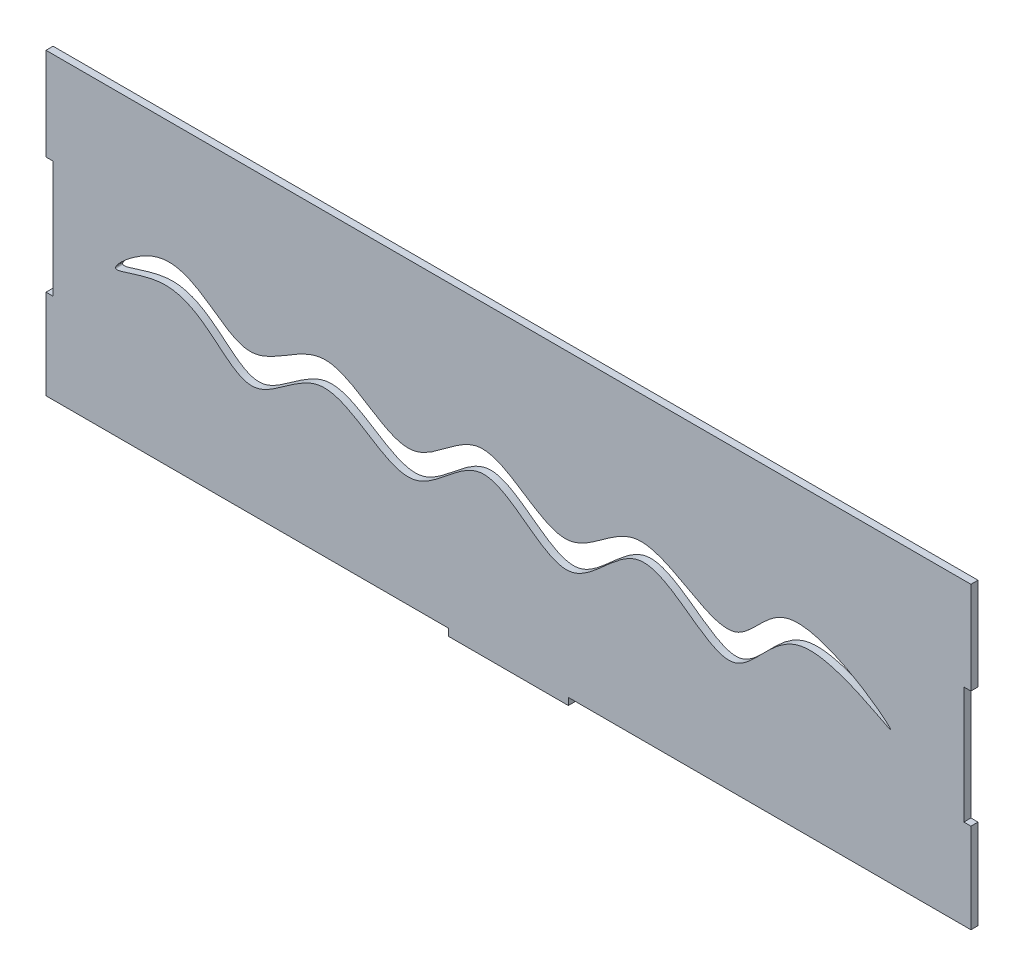
ISO-10303-21;
HEADER;
FILE_DESCRIPTION(('STEP AP214'),'2;1');
FILE_NAME('part.step','',(''),(''),'','','');
FILE_SCHEMA(('AUTOMOTIVE_DESIGN { 1 0 10303 214 1 1 1 1 }'));
ENDSEC;
DATA;
#1=APPLICATION_CONTEXT('core data for automotive mechanical design processes');
#2=APPLICATION_PROTOCOL_DEFINITION('international standard','automotive_design',2000,#1);
#3=PRODUCT_CONTEXT('',#1,'mechanical');
#4=PRODUCT('Part','Part','',(#3));
#5=PRODUCT_RELATED_PRODUCT_CATEGORY('part','',(#4));
#6=PRODUCT_DEFINITION_FORMATION('','',#4);
#7=PRODUCT_DEFINITION_CONTEXT('part definition',#1,'design');
#8=PRODUCT_DEFINITION('design','',#6,#7);
#9=PRODUCT_DEFINITION_SHAPE('','',#8);
#10=(LENGTH_UNIT() NAMED_UNIT(*) SI_UNIT(.MILLI.,.METRE.));
#11=(NAMED_UNIT(*) PLANE_ANGLE_UNIT() SI_UNIT($,.RADIAN.));
#12=(NAMED_UNIT(*) SI_UNIT($,.STERADIAN.) SOLID_ANGLE_UNIT());
#13=UNCERTAINTY_MEASURE_WITH_UNIT(LENGTH_MEASURE(1.E-05),#10,'distance_accuracy_value','');
#14=(GEOMETRIC_REPRESENTATION_CONTEXT(3) GLOBAL_UNCERTAINTY_ASSIGNED_CONTEXT((#13)) GLOBAL_UNIT_ASSIGNED_CONTEXT((#10,
#11,#12)) REPRESENTATION_CONTEXT('',''));
#15=CARTESIAN_POINT('',(0.,0.,0.));
#16=DIRECTION('',(0.,0.,1.));
#17=DIRECTION('',(1.,0.,0.));
#18=AXIS2_PLACEMENT_3D('',#15,#16,#17);
#19=CARTESIAN_POINT('',(0.,33.,2.6));
#20=DIRECTION('',(1.,0.,0.));
#21=DIRECTION('',(0.,1.,0.));
#22=AXIS2_PLACEMENT_3D('',#19,#20,#21);
#23=PLANE('',#22);
#24=DIRECTION('',(0.,-1.,0.));
#25=VECTOR('',#24,1.);
#26=CARTESIAN_POINT('',(0.,33.,0.));
#27=LINE('',#26,#25);
#28=CARTESIAN_POINT('',(0.,33.,0.));
#29=VERTEX_POINT('',#28);
#30=CARTESIAN_POINT('',(0.,0.,0.));
#31=VERTEX_POINT('',#30);
#32=EDGE_CURVE('E190',#29,#31,#27,.T.);
#33=ORIENTED_EDGE('',*,*,#32,.T.);
#34=DIRECTION('',(0.,0.,-1.));
#35=VECTOR('',#34,1.);
#36=CARTESIAN_POINT('',(0.,0.,2.6));
#37=LINE('',#36,#35);
#38=CARTESIAN_POINT('',(0.,0.,2.6));
#39=VERTEX_POINT('',#38);
#40=EDGE_CURVE('E11',#39,#31,#37,.T.);
#41=ORIENTED_EDGE('',*,*,#40,.F.);
#42=DIRECTION('',(0.,-1.,0.));
#43=VECTOR('',#42,1.);
#44=CARTESIAN_POINT('',(0.,33.,2.6));
#45=LINE('',#44,#43);
#46=CARTESIAN_POINT('',(0.,33.,2.6));
#47=VERTEX_POINT('',#46);
#48=EDGE_CURVE('E236',#47,#39,#45,.T.);
#49=ORIENTED_EDGE('',*,*,#48,.F.);
#50=DIRECTION('',(0.,0.,-1.));
#51=VECTOR('',#50,1.);
#52=CARTESIAN_POINT('',(0.,33.,2.6));
#53=LINE('',#52,#51);
#54=EDGE_CURVE('E186',#47,#29,#53,.T.);
#55=ORIENTED_EDGE('',*,*,#54,.T.);
#56=EDGE_LOOP('',(#33,#41,#49,#55));
#57=FACE_BOUND('',#56,.T.);
#58=ADVANCED_FACE('F38',(#57),#23,.F.);
#59=CARTESIAN_POINT('',(0.,0.,2.6));
#60=DIRECTION('',(0.,1.,0.));
#61=DIRECTION('',(-1.,0.,0.));
#62=AXIS2_PLACEMENT_3D('',#59,#60,#61);
#63=PLANE('',#62);
#64=DIRECTION('',(1.,0.,0.));
#65=VECTOR('',#64,1.);
#66=CARTESIAN_POINT('',(0.,0.,0.));
#67=LINE('',#66,#65);
#68=CARTESIAN_POINT('',(148.,0.,0.));
#69=VERTEX_POINT('',#68);
#70=EDGE_CURVE('E194',#31,#69,#67,.T.);
#71=ORIENTED_EDGE('',*,*,#70,.T.);
#72=DIRECTION('',(0.,0.,-1.));
#73=VECTOR('',#72,1.);
#74=CARTESIAN_POINT('',(148.,0.,2.6));
#75=LINE('',#74,#73);
#76=CARTESIAN_POINT('',(148.,0.,2.6));
#77=VERTEX_POINT('',#76);
#78=EDGE_CURVE('E50',#77,#69,#75,.T.);
#79=ORIENTED_EDGE('',*,*,#78,.F.);
#80=DIRECTION('',(1.,0.,0.));
#81=VECTOR('',#80,1.);
#82=CARTESIAN_POINT('',(0.,0.,2.6));
#83=LINE('',#82,#81);
#84=EDGE_CURVE('E125',#39,#77,#83,.T.);
#85=ORIENTED_EDGE('',*,*,#84,.F.);
#86=ORIENTED_EDGE('',*,*,#40,.T.);
#87=EDGE_LOOP('',(#71,#79,#85,#86));
#88=FACE_BOUND('',#87,.T.);
#89=ADVANCED_FACE('F361',(#88),#63,.F.);
#90=CARTESIAN_POINT('',(148.,0.,2.6));
#91=DIRECTION('',(1.,0.,0.));
#92=DIRECTION('',(0.,0.,-1.));
#93=AXIS2_PLACEMENT_3D('',#90,#91,#92);
#94=PLANE('',#93);
#95=DIRECTION('',(0.,-1.,0.));
#96=VECTOR('',#95,1.);
#97=CARTESIAN_POINT('',(148.,0.,0.));
#98=LINE('',#97,#96);
#99=CARTESIAN_POINT('',(148.,-2.60000000000001,0.));
#100=VERTEX_POINT('',#99);
#101=EDGE_CURVE('E197',#69,#100,#98,.T.);
#102=ORIENTED_EDGE('',*,*,#101,.T.);
#103=DIRECTION('',(0.,0.,-1.));
#104=VECTOR('',#103,1.);
#105=CARTESIAN_POINT('',(148.,-2.60000000000001,2.6));
#106=LINE('',#105,#104);
#107=CARTESIAN_POINT('',(148.,-2.60000000000001,2.6));
#108=VERTEX_POINT('',#107);
#109=EDGE_CURVE('E279',#108,#100,#106,.T.);
#110=ORIENTED_EDGE('',*,*,#109,.F.);
#111=DIRECTION('',(0.,-1.,0.));
#112=VECTOR('',#111,1.);
#113=CARTESIAN_POINT('',(148.,0.,2.6));
#114=LINE('',#113,#112);
#115=EDGE_CURVE('E290',#77,#108,#114,.T.);
#116=ORIENTED_EDGE('',*,*,#115,.F.);
#117=ORIENTED_EDGE('',*,*,#78,.T.);
#118=EDGE_LOOP('',(#102,#110,#116,#117));
#119=FACE_BOUND('',#118,.T.);
#120=ADVANCED_FACE('F288',(#119),#94,.F.);
#121=CARTESIAN_POINT('',(148.,-2.60000000000001,2.6));
#122=DIRECTION('',(0.,1.,0.));
#123=DIRECTION('',(-1.,0.,0.));
#124=AXIS2_PLACEMENT_3D('',#121,#122,#123);
#125=PLANE('',#124);
#126=DIRECTION('',(1.,0.,0.));
#127=VECTOR('',#126,1.);
#128=CARTESIAN_POINT('',(148.,-2.60000000000001,0.));
#129=LINE('',#128,#127);
#130=CARTESIAN_POINT('',(192.,-2.59999999999999,0.));
#131=VERTEX_POINT('',#130);
#132=EDGE_CURVE('E200',#100,#131,#129,.T.);
#133=ORIENTED_EDGE('',*,*,#132,.T.);
#134=DIRECTION('',(0.,0.,-1.));
#135=VECTOR('',#134,1.);
#136=CARTESIAN_POINT('',(192.,-2.59999999999999,2.6));
#137=LINE('',#136,#135);
#138=CARTESIAN_POINT('',(192.,-2.59999999999999,2.6));
#139=VERTEX_POINT('',#138);
#140=EDGE_CURVE('E275',#139,#131,#137,.T.);
#141=ORIENTED_EDGE('',*,*,#140,.F.);
#142=DIRECTION('',(1.,0.,0.));
#143=VECTOR('',#142,1.);
#144=CARTESIAN_POINT('',(148.,-2.60000000000001,2.6));
#145=LINE('',#144,#143);
#146=EDGE_CURVE('E309',#108,#139,#145,.T.);
#147=ORIENTED_EDGE('',*,*,#146,.F.);
#148=ORIENTED_EDGE('',*,*,#109,.T.);
#149=EDGE_LOOP('',(#133,#141,#147,#148));
#150=FACE_BOUND('',#149,.T.);
#151=ADVANCED_FACE('F299',(#150),#125,.F.);
#152=CARTESIAN_POINT('',(192.,0.,2.6));
#153=DIRECTION('',(-1.,0.,0.));
#154=DIRECTION('',(0.,0.,1.));
#155=AXIS2_PLACEMENT_3D('',#152,#153,#154);
#156=PLANE('',#155);
#157=DIRECTION('',(0.,1.,0.));
#158=VECTOR('',#157,1.);
#159=CARTESIAN_POINT('',(192.,0.,0.));
#160=LINE('',#159,#158);
#161=CARTESIAN_POINT('',(192.,0.,0.));
#162=VERTEX_POINT('',#161);
#163=EDGE_CURVE('E203',#131,#162,#160,.T.);
#164=ORIENTED_EDGE('',*,*,#163,.T.);
#165=DIRECTION('',(0.,0.,-1.));
#166=VECTOR('',#165,1.);
#167=CARTESIAN_POINT('',(192.,0.,2.6));
#168=LINE('',#167,#166);
#169=CARTESIAN_POINT('',(192.,0.,2.6));
#170=VERTEX_POINT('',#169);
#171=EDGE_CURVE('E271',#170,#162,#168,.T.);
#172=ORIENTED_EDGE('',*,*,#171,.F.);
#173=DIRECTION('',(0.,1.,0.));
#174=VECTOR('',#173,1.);
#175=CARTESIAN_POINT('',(192.,0.,2.6));
#176=LINE('',#175,#174);
#177=EDGE_CURVE('E305',#139,#170,#176,.T.);
#178=ORIENTED_EDGE('',*,*,#177,.F.);
#179=ORIENTED_EDGE('',*,*,#140,.T.);
#180=EDGE_LOOP('',(#164,#172,#178,#179));
#181=FACE_BOUND('',#180,.T.);
#182=ADVANCED_FACE('F303',(#181),#156,.F.);
#183=CARTESIAN_POINT('',(192.,0.,2.6));
#184=DIRECTION('',(0.,1.,0.));
#185=DIRECTION('',(0.,0.,1.));
#186=AXIS2_PLACEMENT_3D('',#183,#184,#185);
#187=PLANE('',#186);
#188=DIRECTION('',(1.,0.,0.));
#189=VECTOR('',#188,1.);
#190=CARTESIAN_POINT('',(192.,0.,0.));
#191=LINE('',#190,#189);
#192=CARTESIAN_POINT('',(340.,0.,0.));
#193=VERTEX_POINT('',#192);
#194=EDGE_CURVE('E206',#162,#193,#191,.T.);
#195=ORIENTED_EDGE('',*,*,#194,.T.);
#196=DIRECTION('',(0.,0.,-1.));
#197=VECTOR('',#196,1.);
#198=CARTESIAN_POINT('',(340.,0.,2.6));
#199=LINE('',#198,#197);
#200=CARTESIAN_POINT('',(340.,0.,2.6));
#201=VERTEX_POINT('',#200);
#202=EDGE_CURVE('E267',#201,#193,#199,.T.);
#203=ORIENTED_EDGE('',*,*,#202,.F.);
#204=DIRECTION('',(1.,0.,0.));
#205=VECTOR('',#204,1.);
#206=CARTESIAN_POINT('',(192.,0.,2.6));
#207=LINE('',#206,#205);
#208=EDGE_CURVE('E308',#170,#201,#207,.T.);
#209=ORIENTED_EDGE('',*,*,#208,.F.);
#210=ORIENTED_EDGE('',*,*,#171,.T.);
#211=EDGE_LOOP('',(#195,#203,#209,#210));
#212=FACE_BOUND('',#211,.T.);
#213=ADVANCED_FACE('F374',(#212),#187,.F.);
#214=CARTESIAN_POINT('',(340.,0.,2.6));
#215=DIRECTION('',(-1.,0.,0.));
#216=DIRECTION('',(0.,0.,1.));
#217=AXIS2_PLACEMENT_3D('',#214,#215,#216);
#218=PLANE('',#217);
#219=DIRECTION('',(0.,1.,0.));
#220=VECTOR('',#219,1.);
#221=CARTESIAN_POINT('',(340.,0.,0.));
#222=LINE('',#221,#220);
#223=CARTESIAN_POINT('',(340.,33.,0.));
#224=VERTEX_POINT('',#223);
#225=EDGE_CURVE('E209',#193,#224,#222,.T.);
#226=ORIENTED_EDGE('',*,*,#225,.T.);
#227=DIRECTION('',(0.,0.,-1.));
#228=VECTOR('',#227,1.);
#229=CARTESIAN_POINT('',(340.,33.,2.6));
#230=LINE('',#229,#228);
#231=CARTESIAN_POINT('',(340.,33.,2.6));
#232=VERTEX_POINT('',#231);
#233=EDGE_CURVE('E263',#232,#224,#230,.T.);
#234=ORIENTED_EDGE('',*,*,#233,.F.);
#235=DIRECTION('',(0.,1.,0.));
#236=VECTOR('',#235,1.);
#237=CARTESIAN_POINT('',(340.,0.,2.6));
#238=LINE('',#237,#236);
#239=EDGE_CURVE('E313',#201,#232,#238,.T.);
#240=ORIENTED_EDGE('',*,*,#239,.F.);
#241=ORIENTED_EDGE('',*,*,#202,.T.);
#242=EDGE_LOOP('',(#226,#234,#240,#241));
#243=FACE_BOUND('',#242,.T.);
#244=ADVANCED_FACE('F377',(#243),#218,.F.);
#245=CARTESIAN_POINT('',(337.4,33.,2.6));
#246=DIRECTION('',(0.,-1.,0.));
#247=DIRECTION('',(0.,0.,-1.));
#248=AXIS2_PLACEMENT_3D('',#245,#246,#247);
#249=PLANE('',#248);
#250=DIRECTION('',(-1.,0.,0.));
#251=VECTOR('',#250,1.);
#252=CARTESIAN_POINT('',(337.4,33.,0.));
#253=LINE('',#252,#251);
#254=CARTESIAN_POINT('',(337.4,33.,0.));
#255=VERTEX_POINT('',#254);
#256=EDGE_CURVE('E212',#224,#255,#253,.T.);
#257=ORIENTED_EDGE('',*,*,#256,.T.);
#258=DIRECTION('',(0.,0.,-1.));
#259=VECTOR('',#258,1.);
#260=CARTESIAN_POINT('',(337.4,33.,2.6));
#261=LINE('',#260,#259);
#262=CARTESIAN_POINT('',(337.4,33.,2.6));
#263=VERTEX_POINT('',#262);
#264=EDGE_CURVE('E259',#263,#255,#261,.T.);
#265=ORIENTED_EDGE('',*,*,#264,.F.);
#266=DIRECTION('',(-1.,0.,0.));
#267=VECTOR('',#266,1.);
#268=CARTESIAN_POINT('',(337.4,33.,2.6));
#269=LINE('',#268,#267);
#270=EDGE_CURVE('E320',#232,#263,#269,.T.);
#271=ORIENTED_EDGE('',*,*,#270,.F.);
#272=ORIENTED_EDGE('',*,*,#233,.T.);
#273=EDGE_LOOP('',(#257,#265,#271,#272));
#274=FACE_BOUND('',#273,.T.);
#275=ADVANCED_FACE('F381',(#274),#249,.F.);
#276=CARTESIAN_POINT('',(337.4,76.,2.6));
#277=DIRECTION('',(-1.,0.,0.));
#278=DIRECTION('',(0.,0.,1.));
#279=AXIS2_PLACEMENT_3D('',#276,#277,#278);
#280=PLANE('',#279);
#281=DIRECTION('',(0.,1.,0.));
#282=VECTOR('',#281,1.);
#283=CARTESIAN_POINT('',(337.4,76.,0.));
#284=LINE('',#283,#282);
#285=CARTESIAN_POINT('',(337.4,76.,0.));
#286=VERTEX_POINT('',#285);
#287=EDGE_CURVE('E215',#255,#286,#284,.T.);
#288=ORIENTED_EDGE('',*,*,#287,.T.);
#289=DIRECTION('',(0.,0.,-1.));
#290=VECTOR('',#289,1.);
#291=CARTESIAN_POINT('',(337.4,76.,2.6));
#292=LINE('',#291,#290);
#293=CARTESIAN_POINT('',(337.4,76.,2.6));
#294=VERTEX_POINT('',#293);
#295=EDGE_CURVE('E255',#294,#286,#292,.T.);
#296=ORIENTED_EDGE('',*,*,#295,.F.);
#297=DIRECTION('',(0.,1.,0.));
#298=VECTOR('',#297,1.);
#299=CARTESIAN_POINT('',(337.4,76.,2.6));
#300=LINE('',#299,#298);
#301=EDGE_CURVE('E323',#263,#294,#300,.T.);
#302=ORIENTED_EDGE('',*,*,#301,.F.);
#303=ORIENTED_EDGE('',*,*,#264,.T.);
#304=EDGE_LOOP('',(#288,#296,#302,#303));
#305=FACE_BOUND('',#304,.T.);
#306=ADVANCED_FACE('F385',(#305),#280,.F.);
#307=CARTESIAN_POINT('',(337.4,76.,2.6));
#308=DIRECTION('',(0.,1.,0.));
#309=DIRECTION('',(-1.,0.,0.));
#310=AXIS2_PLACEMENT_3D('',#307,#308,#309);
#311=PLANE('',#310);
#312=DIRECTION('',(1.,0.,0.));
#313=VECTOR('',#312,1.);
#314=CARTESIAN_POINT('',(337.4,76.,0.));
#315=LINE('',#314,#313);
#316=CARTESIAN_POINT('',(340.,76.,0.));
#317=VERTEX_POINT('',#316);
#318=EDGE_CURVE('E218',#286,#317,#315,.T.);
#319=ORIENTED_EDGE('',*,*,#318,.T.);
#320=DIRECTION('',(0.,0.,-1.));
#321=VECTOR('',#320,1.);
#322=CARTESIAN_POINT('',(340.,76.,2.6));
#323=LINE('',#322,#321);
#324=CARTESIAN_POINT('',(340.,76.,2.6));
#325=VERTEX_POINT('',#324);
#326=EDGE_CURVE('E251',#325,#317,#323,.T.);
#327=ORIENTED_EDGE('',*,*,#326,.F.);
#328=DIRECTION('',(1.,0.,0.));
#329=VECTOR('',#328,1.);
#330=CARTESIAN_POINT('',(337.4,76.,2.6));
#331=LINE('',#330,#329);
#332=EDGE_CURVE('E326',#294,#325,#331,.T.);
#333=ORIENTED_EDGE('',*,*,#332,.F.);
#334=ORIENTED_EDGE('',*,*,#295,.T.);
#335=EDGE_LOOP('',(#319,#327,#333,#334));
#336=FACE_BOUND('',#335,.T.);
#337=ADVANCED_FACE('F389',(#336),#311,.F.);
#338=CARTESIAN_POINT('',(340.,76.,2.6));
#339=DIRECTION('',(-1.,0.,0.));
#340=DIRECTION('',(0.,0.,1.));
#341=AXIS2_PLACEMENT_3D('',#338,#339,#340);
#342=PLANE('',#341);
#343=DIRECTION('',(0.,1.,0.));
#344=VECTOR('',#343,1.);
#345=CARTESIAN_POINT('',(340.,76.,0.));
#346=LINE('',#345,#344);
#347=CARTESIAN_POINT('',(340.,110.,0.));
#348=VERTEX_POINT('',#347);
#349=EDGE_CURVE('E221',#317,#348,#346,.T.);
#350=ORIENTED_EDGE('',*,*,#349,.T.);
#351=DIRECTION('',(0.,0.,-1.));
#352=VECTOR('',#351,1.);
#353=CARTESIAN_POINT('',(340.,110.,2.6));
#354=LINE('',#353,#352);
#355=CARTESIAN_POINT('',(340.,110.,2.6));
#356=VERTEX_POINT('',#355);
#357=EDGE_CURVE('E247',#356,#348,#354,.T.);
#358=ORIENTED_EDGE('',*,*,#357,.F.);
#359=DIRECTION('',(0.,1.,0.));
#360=VECTOR('',#359,1.);
#361=CARTESIAN_POINT('',(340.,76.,2.6));
#362=LINE('',#361,#360);
#363=EDGE_CURVE('E329',#325,#356,#362,.T.);
#364=ORIENTED_EDGE('',*,*,#363,.F.);
#365=ORIENTED_EDGE('',*,*,#326,.T.);
#366=EDGE_LOOP('',(#350,#358,#364,#365));
#367=FACE_BOUND('',#366,.T.);
#368=ADVANCED_FACE('F393',(#367),#342,.F.);
#369=CARTESIAN_POINT('',(340.,110.,2.6));
#370=DIRECTION('',(0.,-1.,0.));
#371=DIRECTION('',(0.,0.,-1.));
#372=AXIS2_PLACEMENT_3D('',#369,#370,#371);
#373=PLANE('',#372);
#374=DIRECTION('',(-1.,0.,0.));
#375=VECTOR('',#374,1.);
#376=CARTESIAN_POINT('',(340.,110.,0.));
#377=LINE('',#376,#375);
#378=CARTESIAN_POINT('',(0.,110.,0.));
#379=VERTEX_POINT('',#378);
#380=EDGE_CURVE('E224',#348,#379,#377,.T.);
#381=ORIENTED_EDGE('',*,*,#380,.T.);
#382=DIRECTION('',(0.,0.,-1.));
#383=VECTOR('',#382,1.);
#384=CARTESIAN_POINT('',(0.,110.,2.6));
#385=LINE('',#384,#383);
#386=CARTESIAN_POINT('',(0.,110.,2.6));
#387=VERTEX_POINT('',#386);
#388=EDGE_CURVE('E243',#387,#379,#385,.T.);
#389=ORIENTED_EDGE('',*,*,#388,.F.);
#390=DIRECTION('',(-1.,0.,0.));
#391=VECTOR('',#390,1.);
#392=CARTESIAN_POINT('',(340.,110.,2.6));
#393=LINE('',#392,#391);
#394=EDGE_CURVE('E332',#356,#387,#393,.T.);
#395=ORIENTED_EDGE('',*,*,#394,.F.);
#396=ORIENTED_EDGE('',*,*,#357,.T.);
#397=EDGE_LOOP('',(#381,#389,#395,#396));
#398=FACE_BOUND('',#397,.T.);
#399=ADVANCED_FACE('F340',(#398),#373,.F.);
#400=CARTESIAN_POINT('',(0.,110.,2.6));
#401=DIRECTION('',(1.,0.,0.));
#402=DIRECTION('',(0.,0.,-1.));
#403=AXIS2_PLACEMENT_3D('',#400,#401,#402);
#404=PLANE('',#403);
#405=DIRECTION('',(0.,-1.,0.));
#406=VECTOR('',#405,1.);
#407=CARTESIAN_POINT('',(0.,110.,0.));
#408=LINE('',#407,#406);
#409=CARTESIAN_POINT('',(0.,76.,0.));
#410=VERTEX_POINT('',#409);
#411=EDGE_CURVE('E227',#379,#410,#408,.T.);
#412=ORIENTED_EDGE('',*,*,#411,.T.);
#413=DIRECTION('',(0.,0.,-1.));
#414=VECTOR('',#413,1.);
#415=CARTESIAN_POINT('',(0.,76.,2.6));
#416=LINE('',#415,#414);
#417=CARTESIAN_POINT('',(0.,76.,2.6));
#418=VERTEX_POINT('',#417);
#419=EDGE_CURVE('E179',#418,#410,#416,.T.);
#420=ORIENTED_EDGE('',*,*,#419,.F.);
#421=DIRECTION('',(0.,-1.,0.));
#422=VECTOR('',#421,1.);
#423=CARTESIAN_POINT('',(0.,110.,2.6));
#424=LINE('',#423,#422);
#425=EDGE_CURVE('E168',#387,#418,#424,.T.);
#426=ORIENTED_EDGE('',*,*,#425,.F.);
#427=ORIENTED_EDGE('',*,*,#388,.T.);
#428=EDGE_LOOP('',(#412,#420,#426,#427));
#429=FACE_BOUND('',#428,.T.);
#430=ADVANCED_FACE('F344',(#429),#404,.F.);
#431=CARTESIAN_POINT('',(0.,76.,2.6));
#432=DIRECTION('',(0.,1.,0.));
#433=DIRECTION('',(-1.,0.,0.));
#434=AXIS2_PLACEMENT_3D('',#431,#432,#433);
#435=PLANE('',#434);
#436=DIRECTION('',(1.,0.,0.));
#437=VECTOR('',#436,1.);
#438=CARTESIAN_POINT('',(0.,76.,0.));
#439=LINE('',#438,#437);
#440=CARTESIAN_POINT('',(2.6,76.,0.));
#441=VERTEX_POINT('',#440);
#442=EDGE_CURVE('E177',#410,#441,#439,.T.);
#443=ORIENTED_EDGE('',*,*,#442,.T.);
#444=DIRECTION('',(0.,0.,-1.));
#445=VECTOR('',#444,1.);
#446=CARTESIAN_POINT('',(2.6,76.,2.6));
#447=LINE('',#446,#445);
#448=CARTESIAN_POINT('',(2.6,76.,2.6));
#449=VERTEX_POINT('',#448);
#450=EDGE_CURVE('E174',#449,#441,#447,.T.);
#451=ORIENTED_EDGE('',*,*,#450,.F.);
#452=DIRECTION('',(1.,0.,0.));
#453=VECTOR('',#452,1.);
#454=CARTESIAN_POINT('',(0.,76.,2.6));
#455=LINE('',#454,#453);
#456=EDGE_CURVE('E162',#418,#449,#455,.T.);
#457=ORIENTED_EDGE('',*,*,#456,.F.);
#458=ORIENTED_EDGE('',*,*,#419,.T.);
#459=EDGE_LOOP('',(#443,#451,#457,#458));
#460=FACE_BOUND('',#459,.T.);
#461=ADVANCED_FACE('F175',(#460),#435,.F.);
#462=CARTESIAN_POINT('',(2.6,76.,2.6));
#463=DIRECTION('',(1.,0.,0.));
#464=DIRECTION('',(0.,1.,0.));
#465=AXIS2_PLACEMENT_3D('',#462,#463,#464);
#466=PLANE('',#465);
#467=DIRECTION('',(0.,-1.,0.));
#468=VECTOR('',#467,1.);
#469=CARTESIAN_POINT('',(2.6,76.,0.));
#470=LINE('',#469,#468);
#471=CARTESIAN_POINT('',(2.60000000000002,33.,0.));
#472=VERTEX_POINT('',#471);
#473=EDGE_CURVE('E111',#441,#472,#470,.T.);
#474=ORIENTED_EDGE('',*,*,#473,.T.);
#475=DIRECTION('',(0.,0.,-1.));
#476=VECTOR('',#475,1.);
#477=CARTESIAN_POINT('',(2.60000000000002,33.,2.6));
#478=LINE('',#477,#476);
#479=CARTESIAN_POINT('',(2.60000000000002,33.,2.6));
#480=VERTEX_POINT('',#479);
#481=EDGE_CURVE('E180',#480,#472,#478,.T.);
#482=ORIENTED_EDGE('',*,*,#481,.F.);
#483=DIRECTION('',(0.,-1.,0.));
#484=VECTOR('',#483,1.);
#485=CARTESIAN_POINT('',(2.6,76.,2.6));
#486=LINE('',#485,#484);
#487=EDGE_CURVE('E166',#449,#480,#486,.T.);
#488=ORIENTED_EDGE('',*,*,#487,.F.);
#489=ORIENTED_EDGE('',*,*,#450,.T.);
#490=EDGE_LOOP('',(#474,#482,#488,#489));
#491=FACE_BOUND('',#490,.T.);
#492=ADVANCED_FACE('F182',(#491),#466,.F.);
#493=CARTESIAN_POINT('',(0.,33.,2.6));
#494=DIRECTION('',(0.,-1.,0.));
#495=DIRECTION('',(0.,0.,-1.));
#496=AXIS2_PLACEMENT_3D('',#493,#494,#495);
#497=PLANE('',#496);
#498=DIRECTION('',(-1.,0.,0.));
#499=VECTOR('',#498,1.);
#500=CARTESIAN_POINT('',(0.,33.,0.));
#501=LINE('',#500,#499);
#502=EDGE_CURVE('E117',#472,#29,#501,.T.);
#503=ORIENTED_EDGE('',*,*,#502,.T.);
#504=ORIENTED_EDGE('',*,*,#54,.F.);
#505=DIRECTION('',(-1.,0.,0.));
#506=VECTOR('',#505,1.);
#507=CARTESIAN_POINT('',(0.,33.,2.6));
#508=LINE('',#507,#506);
#509=EDGE_CURVE('E58',#480,#47,#508,.T.);
#510=ORIENTED_EDGE('',*,*,#509,.F.);
#511=ORIENTED_EDGE('',*,*,#481,.T.);
#512=EDGE_LOOP('',(#503,#504,#510,#511));
#513=FACE_BOUND('',#512,.T.);
#514=ADVANCED_FACE('F348',(#513),#497,.F.);
#515=CARTESIAN_POINT('',(0.,0.,2.6));
#516=DIRECTION('',(0.,0.,1.));
#517=DIRECTION('',(1.,0.,0.));
#518=AXIS2_PLACEMENT_3D('',#515,#516,#517);
#519=PLANE('',#518);
#520=CARTESIAN_POINT('',(25.6444860834933,53.3876972189647,2.6));
#521=CARTESIAN_POINT('',(26.402454626933,52.2207003317055,2.6));
#522=CARTESIAN_POINT('',(54.6131156363723,66.4853400482872,2.6));
#523=CARTESIAN_POINT('',(72.3222248492413,26.8628793439942,2.6));
#524=CARTESIAN_POINT('',(103.38932352671,66.9492124530696,2.6));
#525=CARTESIAN_POINT('',(133.511802205413,26.5124848692906,2.6));
#526=CARTESIAN_POINT('',(161.294361754301,70.1633940503084,2.6));
#527=CARTESIAN_POINT('',(191.921496129215,24.5704373821916,2.6));
#528=CARTESIAN_POINT('',(218.953225351617,72.9855466061669,2.6));
#529=CARTESIAN_POINT('',(253.07450266081,25.1433982473416,2.6));
#530=CARTESIAN_POINT('',(272.870566121087,73.1292753342744,2.6));
#531=CARTESIAN_POINT('',(332.23988237706,33.1261918471204,2.6));
#532=CARTESIAN_POINT('',(272.655308019521,80.2849572590105,2.6));
#533=CARTESIAN_POINT('',(252.186172311717,38.0505526071932,2.6));
#534=CARTESIAN_POINT('',(218.600368952912,76.6495238720534,2.6));
#535=CARTESIAN_POINT('',(190.514289437846,36.947235096998,2.6));
#536=CARTESIAN_POINT('',(160.789203194343,76.5579418913022,2.6));
#537=CARTESIAN_POINT('',(133.07105760023,36.9977748618524,2.6));
#538=CARTESIAN_POINT('',(103.997305336092,75.3027240556504,2.6));
#539=CARTESIAN_POINT('',(71.9214972429167,37.9867827246115,2.6));
#540=CARTESIAN_POINT('',(50.1116098884128,77.4889677172226,2.6));
#541=CARTESIAN_POINT('',(24.8415321786502,54.6239552611682,2.6));
#542=CARTESIAN_POINT('',(25.6444860834933,53.3876972189647,2.6));
#543=B_SPLINE_CURVE_WITH_KNOTS('',3,(#520,#521,#522,#523,#524,#525,#526,#527,#528,#529,#530,
#531,#532,#533,#534,#535,#536,#537,#538,#539,#540,#541,#542),.UNSPECIFIED.,.T.,.F.,(4,1,1,1,1,1,
1,1,1,1,1,1,1,1,1,1,1,1,1,1,4),(0.,0.0278069486164499,0.0869377264013241,0.130819718011234,
0.187934124844961,0.234651034292088,0.290562004237246,0.340182728979776,0.398142703673239,
0.447853108653213,0.502049553651439,0.56734944058828,0.604872069416674,0.665193091400721,
0.710585420648425,0.765697114363217,0.810689913017348,0.865489886507314,0.912139861582313,
0.970542711611716,1.),.UNSPECIFIED.);
#544=CARTESIAN_POINT('',(25.6444860834933,53.3876972189647,2.6));
#545=VERTEX_POINT('',#544);
#546=EDGE_CURVE('E449',#545,#545,#543,.T.);
#547=ORIENTED_EDGE('',*,*,#546,.F.);
#548=EDGE_LOOP('',(#547));
#549=FACE_BOUND('',#548,.T.);
#550=ORIENTED_EDGE('',*,*,#48,.T.);
#551=ORIENTED_EDGE('',*,*,#84,.T.);
#552=ORIENTED_EDGE('',*,*,#115,.T.);
#553=ORIENTED_EDGE('',*,*,#146,.T.);
#554=ORIENTED_EDGE('',*,*,#177,.T.);
#555=ORIENTED_EDGE('',*,*,#208,.T.);
#556=ORIENTED_EDGE('',*,*,#239,.T.);
#557=ORIENTED_EDGE('',*,*,#270,.T.);
#558=ORIENTED_EDGE('',*,*,#301,.T.);
#559=ORIENTED_EDGE('',*,*,#332,.T.);
#560=ORIENTED_EDGE('',*,*,#363,.T.);
#561=ORIENTED_EDGE('',*,*,#394,.T.);
#562=ORIENTED_EDGE('',*,*,#425,.T.);
#563=ORIENTED_EDGE('',*,*,#456,.T.);
#564=ORIENTED_EDGE('',*,*,#487,.T.);
#565=ORIENTED_EDGE('',*,*,#509,.T.);
#566=EDGE_LOOP('',(#550,#551,#552,#553,#554,#555,#556,#557,#558,#559,#560,#561,#562,#563,#564,#565));
#567=FACE_BOUND('',#566,.T.);
#568=ADVANCED_FACE('F164',(#549,#567),#519,.T.);
#569=CARTESIAN_POINT('',(0.,0.,0.));
#570=DIRECTION('',(0.,0.,1.));
#571=DIRECTION('',(1.,0.,0.));
#572=AXIS2_PLACEMENT_3D('',#569,#570,#571);
#573=PLANE('',#572);
#574=CARTESIAN_POINT('',(25.6444860834933,53.3876972189647,0.));
#575=CARTESIAN_POINT('',(26.402454626933,52.2207003317055,0.));
#576=CARTESIAN_POINT('',(54.6131156363723,66.4853400482872,0.));
#577=CARTESIAN_POINT('',(72.3222248492413,26.8628793439942,0.));
#578=CARTESIAN_POINT('',(103.38932352671,66.9492124530696,0.));
#579=CARTESIAN_POINT('',(133.511802205413,26.5124848692906,0.));
#580=CARTESIAN_POINT('',(161.294361754301,70.1633940503084,0.));
#581=CARTESIAN_POINT('',(191.921496129215,24.5704373821916,0.));
#582=CARTESIAN_POINT('',(218.953225351617,72.9855466061669,0.));
#583=CARTESIAN_POINT('',(253.07450266081,25.1433982473416,0.));
#584=CARTESIAN_POINT('',(272.870566121087,73.1292753342744,0.));
#585=CARTESIAN_POINT('',(332.23988237706,33.1261918471204,0.));
#586=CARTESIAN_POINT('',(272.655308019521,80.2849572590105,0.));
#587=CARTESIAN_POINT('',(252.186172311717,38.0505526071932,0.));
#588=CARTESIAN_POINT('',(218.600368952912,76.6495238720534,0.));
#589=CARTESIAN_POINT('',(190.514289437846,36.947235096998,0.));
#590=CARTESIAN_POINT('',(160.789203194343,76.5579418913022,0.));
#591=CARTESIAN_POINT('',(133.07105760023,36.9977748618524,0.));
#592=CARTESIAN_POINT('',(103.997305336092,75.3027240556504,0.));
#593=CARTESIAN_POINT('',(71.9214972429167,37.9867827246115,0.));
#594=CARTESIAN_POINT('',(50.1116098884128,77.4889677172226,0.));
#595=CARTESIAN_POINT('',(24.8415321786502,54.6239552611682,0.));
#596=CARTESIAN_POINT('',(25.6444860834933,53.3876972189647,0.));
#597=B_SPLINE_CURVE_WITH_KNOTS('',3,(#574,#575,#576,#577,#578,#579,#580,#581,#582,#583,#584,
#585,#586,#587,#588,#589,#590,#591,#592,#593,#594,#595,#596),.UNSPECIFIED.,.T.,.F.,(4,1,1,1,1,1,
1,1,1,1,1,1,1,1,1,1,1,1,1,1,4),(0.,0.0278069486164499,0.0869377264013241,0.130819718011234,
0.187934124844961,0.234651034292088,0.290562004237246,0.340182728979776,0.398142703673239,
0.447853108653213,0.502049553651439,0.56734944058828,0.604872069416674,0.665193091400721,
0.710585420648425,0.765697114363217,0.810689913017348,0.865489886507314,0.912139861582313,
0.970542711611716,1.),.UNSPECIFIED.);
#598=CARTESIAN_POINT('',(25.6444860834933,53.3876972189647,0.));
#599=VERTEX_POINT('',#598);
#600=EDGE_CURVE('E41',#599,#599,#597,.T.);
#601=ORIENTED_EDGE('',*,*,#600,.T.);
#602=EDGE_LOOP('',(#601));
#603=FACE_BOUND('',#602,.T.);
#604=ORIENTED_EDGE('',*,*,#32,.F.);
#605=ORIENTED_EDGE('',*,*,#502,.F.);
#606=ORIENTED_EDGE('',*,*,#473,.F.);
#607=ORIENTED_EDGE('',*,*,#442,.F.);
#608=ORIENTED_EDGE('',*,*,#411,.F.);
#609=ORIENTED_EDGE('',*,*,#380,.F.);
#610=ORIENTED_EDGE('',*,*,#349,.F.);
#611=ORIENTED_EDGE('',*,*,#318,.F.);
#612=ORIENTED_EDGE('',*,*,#287,.F.);
#613=ORIENTED_EDGE('',*,*,#256,.F.);
#614=ORIENTED_EDGE('',*,*,#225,.F.);
#615=ORIENTED_EDGE('',*,*,#194,.F.);
#616=ORIENTED_EDGE('',*,*,#163,.F.);
#617=ORIENTED_EDGE('',*,*,#132,.F.);
#618=ORIENTED_EDGE('',*,*,#101,.F.);
#619=ORIENTED_EDGE('',*,*,#70,.F.);
#620=EDGE_LOOP('',(#604,#605,#606,#607,#608,#609,#610,#611,#612,#613,#614,#615,#616,#617,#618,#619));
#621=FACE_BOUND('',#620,.T.);
#622=ADVANCED_FACE('F294',(#603,#621),#573,.F.);
#623=CARTESIAN_POINT('',(25.6444860834933,53.3876972189647,-7.4));
#624=CARTESIAN_POINT('',(26.402454626933,52.2207003317055,-7.4));
#625=CARTESIAN_POINT('',(54.6131156363723,66.4853400482872,-7.4));
#626=CARTESIAN_POINT('',(72.3222248492413,26.8628793439942,-7.4));
#627=CARTESIAN_POINT('',(103.38932352671,66.9492124530696,-7.4));
#628=CARTESIAN_POINT('',(133.511802205413,26.5124848692906,-7.4));
#629=CARTESIAN_POINT('',(161.294361754301,70.1633940503084,-7.4));
#630=CARTESIAN_POINT('',(191.921496129215,24.5704373821916,-7.4));
#631=CARTESIAN_POINT('',(218.953225351617,72.9855466061669,-7.4));
#632=CARTESIAN_POINT('',(253.07450266081,25.1433982473416,-7.4));
#633=CARTESIAN_POINT('',(272.870566121087,73.1292753342744,-7.4));
#634=CARTESIAN_POINT('',(332.23988237706,33.1261918471204,-7.4));
#635=CARTESIAN_POINT('',(272.655308019521,80.2849572590105,-7.4));
#636=CARTESIAN_POINT('',(252.186172311717,38.0505526071932,-7.4));
#637=CARTESIAN_POINT('',(218.600368952912,76.6495238720534,-7.4));
#638=CARTESIAN_POINT('',(190.514289437846,36.947235096998,-7.4));
#639=CARTESIAN_POINT('',(160.789203194343,76.5579418913022,-7.4));
#640=CARTESIAN_POINT('',(133.07105760023,36.9977748618524,-7.4));
#641=CARTESIAN_POINT('',(103.997305336092,75.3027240556504,-7.4));
#642=CARTESIAN_POINT('',(71.9214972429167,37.9867827246115,-7.4));
#643=CARTESIAN_POINT('',(50.1116098884128,77.4889677172226,-7.4));
#644=CARTESIAN_POINT('',(24.8415321786502,54.6239552611682,-7.4));
#645=CARTESIAN_POINT('',(25.6444860834933,53.3876972189647,-7.4));
#646=B_SPLINE_CURVE_WITH_KNOTS('',3,(#623,#624,#625,#626,#627,#628,#629,#630,#631,#632,#633,
#634,#635,#636,#637,#638,#639,#640,#641,#642,#643,#644,#645),.UNSPECIFIED.,.T.,.F.,(4,1,1,1,1,1,
1,1,1,1,1,1,1,1,1,1,1,1,1,1,4),(0.,0.0278069486164499,0.0869377264013241,0.130819718011234,
0.187934124844961,0.234651034292088,0.290562004237246,0.340182728979776,0.398142703673239,
0.447853108653213,0.502049553651439,0.56734944058828,0.604872069416674,0.665193091400721,
0.710585420648425,0.765697114363217,0.810689913017348,0.865489886507314,0.912139861582313,
0.970542711611716,1.),.UNSPECIFIED.);
#647=DIRECTION('',(0.,0.,1.));
#648=VECTOR('',#647,1.);
#649=SURFACE_OF_LINEAR_EXTRUSION('',#646,#648);
#650=ORIENTED_EDGE('',*,*,#546,.T.);
#651=EDGE_LOOP('',(#650));
#652=FACE_BOUND('',#651,.T.);
#653=ORIENTED_EDGE('',*,*,#600,.F.);
#654=EDGE_LOOP('',(#653));
#655=FACE_BOUND('',#654,.T.);
#656=ADVANCED_FACE('F426',(#652,#655),#649,.F.);
#657=CLOSED_SHELL('',(#58,#89,#120,#151,#182,#213,#244,#275,#306,#337,#368,#399,#430,#461,#492,
#514,#568,#622,#656));
#658=MANIFOLD_SOLID_BREP('B2',#657);
#659=ADVANCED_BREP_SHAPE_REPRESENTATION('',(#18,#658),#14);
#660=SHAPE_DEFINITION_REPRESENTATION(#9,#659);
ENDSEC;
END-ISO-10303-21;
